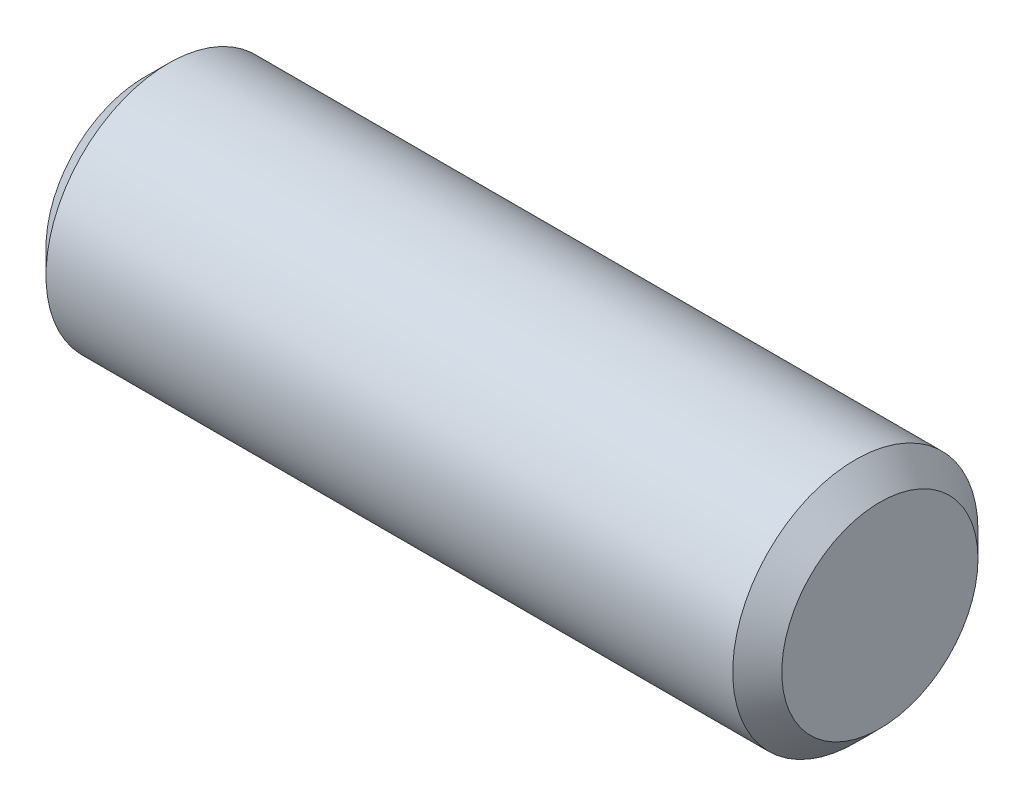
ISO-10303-21;
HEADER;
FILE_DESCRIPTION(('STEP AP214'),'2;1');
FILE_NAME('part.step','',(''),(''),'','','');
FILE_SCHEMA(('AUTOMOTIVE_DESIGN { 1 0 10303 214 1 1 1 1 }'));
ENDSEC;
DATA;
#1=APPLICATION_CONTEXT('core data for automotive mechanical design processes');
#2=APPLICATION_PROTOCOL_DEFINITION('international standard','automotive_design',2000,#1);
#3=PRODUCT_CONTEXT('',#1,'mechanical');
#4=PRODUCT('Part','Part','',(#3));
#5=PRODUCT_RELATED_PRODUCT_CATEGORY('part','',(#4));
#6=PRODUCT_DEFINITION_FORMATION('','',#4);
#7=PRODUCT_DEFINITION_CONTEXT('part definition',#1,'design');
#8=PRODUCT_DEFINITION('design','',#6,#7);
#9=PRODUCT_DEFINITION_SHAPE('','',#8);
#10=(LENGTH_UNIT() NAMED_UNIT(*) SI_UNIT(.MILLI.,.METRE.));
#11=(NAMED_UNIT(*) PLANE_ANGLE_UNIT() SI_UNIT($,.RADIAN.));
#12=(NAMED_UNIT(*) SI_UNIT($,.STERADIAN.) SOLID_ANGLE_UNIT());
#13=UNCERTAINTY_MEASURE_WITH_UNIT(LENGTH_MEASURE(1.E-05),#10,'distance_accuracy_value','');
#14=(GEOMETRIC_REPRESENTATION_CONTEXT(3) GLOBAL_UNCERTAINTY_ASSIGNED_CONTEXT((#13)) GLOBAL_UNIT_ASSIGNED_CONTEXT((#10,
#11,#12)) REPRESENTATION_CONTEXT('',''));
#15=CARTESIAN_POINT('',(0.,0.,0.));
#16=DIRECTION('',(0.,0.,1.));
#17=DIRECTION('',(1.,0.,0.));
#18=AXIS2_PLACEMENT_3D('',#15,#16,#17);
#19=CARTESIAN_POINT('',(-9.525,0.,0.));
#20=DIRECTION('',(1.,0.,0.));
#21=DIRECTION('',(0.,0.,-1.));
#22=AXIS2_PLACEMENT_3D('',#19,#20,#21);
#23=CYLINDRICAL_SURFACE('',#22,3.175);
#24=CARTESIAN_POINT('',(8.89000000000001,0.,0.));
#25=DIRECTION('',(1.,0.,0.));
#26=DIRECTION('',(0.,0.,-1.));
#27=AXIS2_PLACEMENT_3D('',#24,#25,#26);
#28=CIRCLE('',#27,3.175);
#29=CARTESIAN_POINT('',(8.89000000000001,0.,-3.175));
#30=VERTEX_POINT('',#29);
#31=EDGE_CURVE('E36',#30,#30,#28,.F.);
#32=ORIENTED_EDGE('',*,*,#31,.T.);
#33=EDGE_LOOP('',(#32));
#34=FACE_BOUND('',#33,.T.);
#35=CARTESIAN_POINT('',(-8.88999999999999,0.,0.));
#36=DIRECTION('',(1.,0.,0.));
#37=DIRECTION('',(0.,0.,-1.));
#38=AXIS2_PLACEMENT_3D('',#35,#36,#37);
#39=CIRCLE('',#38,3.175);
#40=CARTESIAN_POINT('',(-8.88999999999999,0.,-3.175));
#41=VERTEX_POINT('',#40);
#42=EDGE_CURVE('E40',#41,#41,#39,.T.);
#43=ORIENTED_EDGE('',*,*,#42,.T.);
#44=EDGE_LOOP('',(#43));
#45=FACE_BOUND('',#44,.T.);
#46=ADVANCED_FACE('F29',(#34,#45),#23,.T.);
#47=CARTESIAN_POINT('',(-9.525,0.,0.));
#48=DIRECTION('',(1.,0.,0.));
#49=DIRECTION('',(0.,0.,-1.));
#50=AXIS2_PLACEMENT_3D('',#47,#48,#49);
#51=PLANE('',#50);
#52=CARTESIAN_POINT('',(-9.525,0.,0.));
#53=DIRECTION('',(1.,0.,0.));
#54=DIRECTION('',(0.,0.,-1.));
#55=AXIS2_PLACEMENT_3D('',#52,#53,#54);
#56=CIRCLE('',#55,2.53999999999998);
#57=CARTESIAN_POINT('',(-9.525,0.,-2.53999999999998));
#58=VERTEX_POINT('',#57);
#59=EDGE_CURVE('E10',#58,#58,#56,.F.);
#60=ORIENTED_EDGE('',*,*,#59,.T.);
#61=EDGE_LOOP('',(#60));
#62=FACE_BOUND('',#61,.T.);
#63=ADVANCED_FACE('F60',(#62),#51,.F.);
#64=CARTESIAN_POINT('',(9.525,0.,0.));
#65=DIRECTION('',(1.,0.,0.));
#66=DIRECTION('',(0.,0.,-1.));
#67=AXIS2_PLACEMENT_3D('',#64,#65,#66);
#68=PLANE('',#67);
#69=CARTESIAN_POINT('',(9.525,0.,0.));
#70=DIRECTION('',(1.,0.,0.));
#71=DIRECTION('',(0.,0.,-1.));
#72=AXIS2_PLACEMENT_3D('',#69,#70,#71);
#73=CIRCLE('',#72,2.54000000000001);
#74=CARTESIAN_POINT('',(9.525,0.,-2.54000000000001));
#75=VERTEX_POINT('',#74);
#76=EDGE_CURVE('E44',#75,#75,#73,.T.);
#77=ORIENTED_EDGE('',*,*,#76,.T.);
#78=EDGE_LOOP('',(#77));
#79=FACE_BOUND('',#78,.T.);
#80=ADVANCED_FACE('F50',(#79),#68,.T.);
#81=CARTESIAN_POINT('',(9.525,0.,0.));
#82=DIRECTION('',(-1.,0.,0.));
#83=DIRECTION('',(0.,0.,1.));
#84=AXIS2_PLACEMENT_3D('',#81,#82,#83);
#85=CONICAL_SURFACE('',#84,2.54,0.785398163397447);
#86=ORIENTED_EDGE('',*,*,#31,.F.);
#87=EDGE_LOOP('',(#86));
#88=FACE_BOUND('',#87,.T.);
#89=ORIENTED_EDGE('',*,*,#76,.F.);
#90=EDGE_LOOP('',(#89));
#91=FACE_BOUND('',#90,.T.);
#92=ADVANCED_FACE('F52',(#88,#91),#85,.T.);
#93=CARTESIAN_POINT('',(-8.88999999999999,0.,0.));
#94=DIRECTION('',(1.,0.,0.));
#95=DIRECTION('',(0.,0.,-1.));
#96=AXIS2_PLACEMENT_3D('',#93,#94,#95);
#97=CONICAL_SURFACE('',#96,3.175,0.785398163397449);
#98=ORIENTED_EDGE('',*,*,#59,.F.);
#99=EDGE_LOOP('',(#98));
#100=FACE_BOUND('',#99,.T.);
#101=ORIENTED_EDGE('',*,*,#42,.F.);
#102=EDGE_LOOP('',(#101));
#103=FACE_BOUND('',#102,.T.);
#104=ADVANCED_FACE('F31',(#100,#103),#97,.T.);
#105=CLOSED_SHELL('',(#46,#63,#80,#92,#104));
#106=MANIFOLD_SOLID_BREP('B2',#105);
#107=ADVANCED_BREP_SHAPE_REPRESENTATION('',(#18,#106),#14);
#108=SHAPE_DEFINITION_REPRESENTATION(#9,#107);
ENDSEC;
END-ISO-10303-21;
